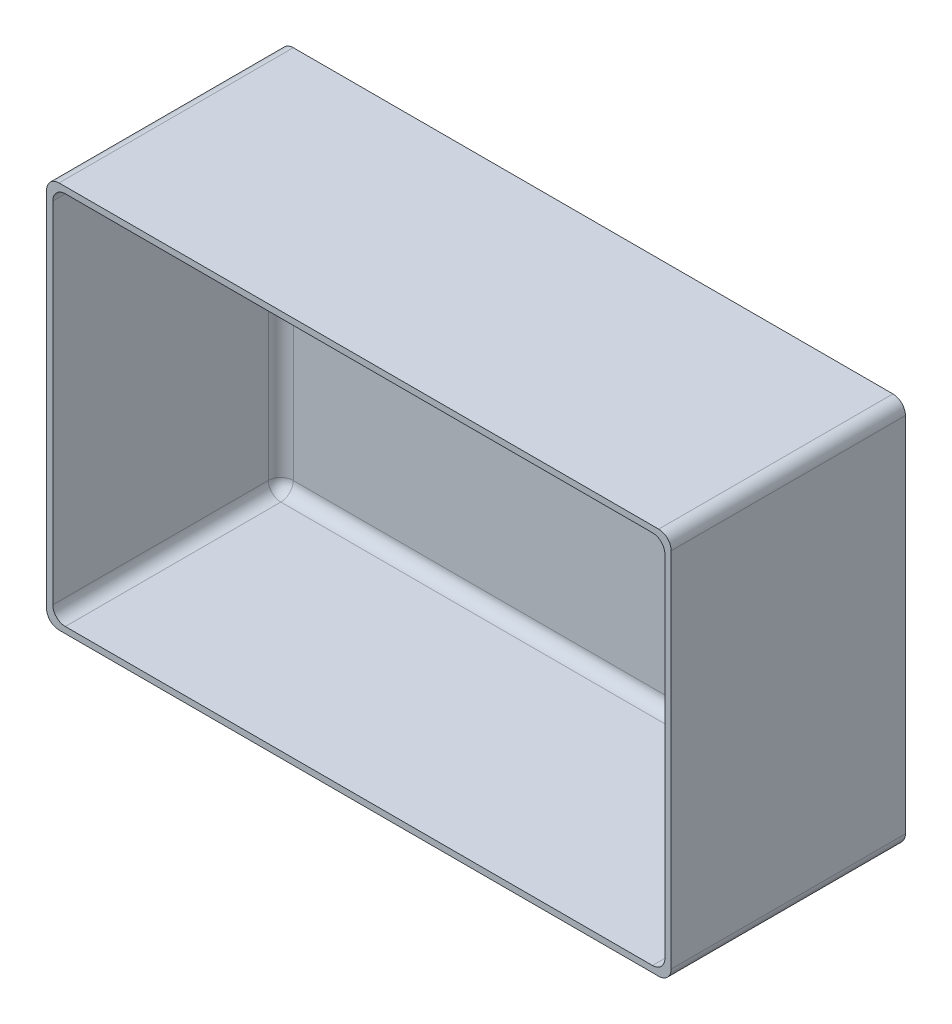
ISO-10303-21;
HEADER;
FILE_DESCRIPTION(('STEP AP214'),'2;1');
FILE_NAME('part.step','',(''),(''),'','','');
FILE_SCHEMA(('AUTOMOTIVE_DESIGN { 1 0 10303 214 1 1 1 1 }'));
ENDSEC;
DATA;
#1=APPLICATION_CONTEXT('core data for automotive mechanical design processes');
#2=APPLICATION_PROTOCOL_DEFINITION('international standard','automotive_design',2000,#1);
#3=PRODUCT_CONTEXT('',#1,'mechanical');
#4=PRODUCT('Part','Part','',(#3));
#5=PRODUCT_RELATED_PRODUCT_CATEGORY('part','',(#4));
#6=PRODUCT_DEFINITION_FORMATION('','',#4);
#7=PRODUCT_DEFINITION_CONTEXT('part definition',#1,'design');
#8=PRODUCT_DEFINITION('design','',#6,#7);
#9=PRODUCT_DEFINITION_SHAPE('','',#8);
#10=(LENGTH_UNIT() NAMED_UNIT(*) SI_UNIT(.MILLI.,.METRE.));
#11=(NAMED_UNIT(*) PLANE_ANGLE_UNIT() SI_UNIT($,.RADIAN.));
#12=(NAMED_UNIT(*) SI_UNIT($,.STERADIAN.) SOLID_ANGLE_UNIT());
#13=UNCERTAINTY_MEASURE_WITH_UNIT(LENGTH_MEASURE(1.E-05),#10,'distance_accuracy_value','');
#14=(GEOMETRIC_REPRESENTATION_CONTEXT(3) GLOBAL_UNCERTAINTY_ASSIGNED_CONTEXT((#13)) GLOBAL_UNIT_ASSIGNED_CONTEXT((#10,
#11,#12)) REPRESENTATION_CONTEXT('',''));
#15=CARTESIAN_POINT('',(0.,0.,0.));
#16=DIRECTION('',(0.,0.,1.));
#17=DIRECTION('',(1.,0.,0.));
#18=AXIS2_PLACEMENT_3D('',#15,#16,#17);
#19=CARTESIAN_POINT('',(40.,24.8,30.));
#20=DIRECTION('',(-1.,0.,0.));
#21=DIRECTION('',(0.,-1.,0.));
#22=AXIS2_PLACEMENT_3D('',#19,#20,#21);
#23=PLANE('',#22);
#24=DIRECTION('',(0.,1.,0.));
#25=VECTOR('',#24,1.);
#26=CARTESIAN_POINT('',(40.,24.8,30.));
#27=LINE('',#26,#25);
#28=CARTESIAN_POINT('',(40.,-23.2,30.));
#29=VERTEX_POINT('',#28);
#30=CARTESIAN_POINT('',(40.,23.2,30.));
#31=VERTEX_POINT('',#30);
#32=EDGE_CURVE('E178',#29,#31,#27,.T.);
#33=ORIENTED_EDGE('',*,*,#32,.F.);
#34=DIRECTION('',(0.,0.,-1.));
#35=VECTOR('',#34,1.);
#36=CARTESIAN_POINT('',(40.,-23.2,30.));
#37=LINE('',#36,#35);
#38=CARTESIAN_POINT('',(40.,-23.2,0.));
#39=VERTEX_POINT('',#38);
#40=EDGE_CURVE('E163',#29,#39,#37,.T.);
#41=ORIENTED_EDGE('',*,*,#40,.T.);
#42=DIRECTION('',(0.,1.,0.));
#43=VECTOR('',#42,1.);
#44=CARTESIAN_POINT('',(40.,24.8,0.));
#45=LINE('',#44,#43);
#46=CARTESIAN_POINT('',(40.,23.2,0.));
#47=VERTEX_POINT('',#46);
#48=EDGE_CURVE('E175',#39,#47,#45,.T.);
#49=ORIENTED_EDGE('',*,*,#48,.T.);
#50=DIRECTION('',(0.,0.,-1.));
#51=VECTOR('',#50,1.);
#52=CARTESIAN_POINT('',(40.,23.2,30.));
#53=LINE('',#52,#51);
#54=EDGE_CURVE('E180',#47,#31,#53,.F.);
#55=ORIENTED_EDGE('',*,*,#54,.T.);
#56=EDGE_LOOP('',(#33,#41,#49,#55));
#57=FACE_BOUND('',#56,.T.);
#58=ADVANCED_FACE('F33',(#57),#23,.F.);
#59=CARTESIAN_POINT('',(-40.,24.8,30.));
#60=DIRECTION('',(0.,-1.,0.));
#61=DIRECTION('',(0.,0.,-1.));
#62=AXIS2_PLACEMENT_3D('',#59,#60,#61);
#63=PLANE('',#62);
#64=DIRECTION('',(-1.,0.,0.));
#65=VECTOR('',#64,1.);
#66=CARTESIAN_POINT('',(-40.,24.8,0.));
#67=LINE('',#66,#65);
#68=CARTESIAN_POINT('',(38.4,24.8,0.));
#69=VERTEX_POINT('',#68);
#70=CARTESIAN_POINT('',(-38.4,24.8,0.));
#71=VERTEX_POINT('',#70);
#72=EDGE_CURVE('E185',#69,#71,#67,.T.);
#73=ORIENTED_EDGE('',*,*,#72,.T.);
#74=DIRECTION('',(0.,0.,-1.));
#75=VECTOR('',#74,1.);
#76=CARTESIAN_POINT('',(-38.4,24.8,30.));
#77=LINE('',#76,#75);
#78=CARTESIAN_POINT('',(-38.4,24.8,30.));
#79=VERTEX_POINT('',#78);
#80=EDGE_CURVE('E225',#71,#79,#77,.F.);
#81=ORIENTED_EDGE('',*,*,#80,.T.);
#82=DIRECTION('',(-1.,0.,0.));
#83=VECTOR('',#82,1.);
#84=CARTESIAN_POINT('',(-40.,24.8,30.));
#85=LINE('',#84,#83);
#86=CARTESIAN_POINT('',(38.4,24.8,30.));
#87=VERTEX_POINT('',#86);
#88=EDGE_CURVE('E310',#87,#79,#85,.T.);
#89=ORIENTED_EDGE('',*,*,#88,.F.);
#90=DIRECTION('',(0.,0.,-1.));
#91=VECTOR('',#90,1.);
#92=CARTESIAN_POINT('',(38.4,24.8,30.));
#93=LINE('',#92,#91);
#94=EDGE_CURVE('E222',#87,#69,#93,.T.);
#95=ORIENTED_EDGE('',*,*,#94,.T.);
#96=EDGE_LOOP('',(#73,#81,#89,#95));
#97=FACE_BOUND('',#96,.T.);
#98=ADVANCED_FACE('F335',(#97),#63,.F.);
#99=CARTESIAN_POINT('',(-40.,24.8,30.));
#100=DIRECTION('',(1.,0.,0.));
#101=DIRECTION('',(0.,0.,-1.));
#102=AXIS2_PLACEMENT_3D('',#99,#100,#101);
#103=PLANE('',#102);
#104=DIRECTION('',(0.,-1.,0.));
#105=VECTOR('',#104,1.);
#106=CARTESIAN_POINT('',(-40.,24.8,30.));
#107=LINE('',#106,#105);
#108=CARTESIAN_POINT('',(-40.,23.2,30.));
#109=VERTEX_POINT('',#108);
#110=CARTESIAN_POINT('',(-40.,-23.2,30.));
#111=VERTEX_POINT('',#110);
#112=EDGE_CURVE('E312',#109,#111,#107,.T.);
#113=ORIENTED_EDGE('',*,*,#112,.F.);
#114=DIRECTION('',(0.,0.,-1.));
#115=VECTOR('',#114,1.);
#116=CARTESIAN_POINT('',(-40.,23.2,30.));
#117=LINE('',#116,#115);
#118=CARTESIAN_POINT('',(-40.,23.2,0.));
#119=VERTEX_POINT('',#118);
#120=EDGE_CURVE('E219',#109,#119,#117,.T.);
#121=ORIENTED_EDGE('',*,*,#120,.T.);
#122=DIRECTION('',(0.,-1.,0.));
#123=VECTOR('',#122,1.);
#124=CARTESIAN_POINT('',(-40.,24.8,0.));
#125=LINE('',#124,#123);
#126=CARTESIAN_POINT('',(-40.,-23.2,0.));
#127=VERTEX_POINT('',#126);
#128=EDGE_CURVE('E189',#119,#127,#125,.T.);
#129=ORIENTED_EDGE('',*,*,#128,.T.);
#130=DIRECTION('',(0.,0.,-1.));
#131=VECTOR('',#130,1.);
#132=CARTESIAN_POINT('',(-40.,-23.2,30.));
#133=LINE('',#132,#131);
#134=EDGE_CURVE('E217',#127,#111,#133,.F.);
#135=ORIENTED_EDGE('',*,*,#134,.T.);
#136=EDGE_LOOP('',(#113,#121,#129,#135));
#137=FACE_BOUND('',#136,.T.);
#138=ADVANCED_FACE('F328',(#137),#103,.F.);
#139=CARTESIAN_POINT('',(-40.,-24.8,30.));
#140=DIRECTION('',(0.,1.,0.));
#141=DIRECTION('',(0.,0.,1.));
#142=AXIS2_PLACEMENT_3D('',#139,#140,#141);
#143=PLANE('',#142);
#144=DIRECTION('',(1.,0.,0.));
#145=VECTOR('',#144,1.);
#146=CARTESIAN_POINT('',(-40.,-24.8,0.));
#147=LINE('',#146,#145);
#148=CARTESIAN_POINT('',(-38.4,-24.8,0.));
#149=VERTEX_POINT('',#148);
#150=CARTESIAN_POINT('',(38.4,-24.8,0.));
#151=VERTEX_POINT('',#150);
#152=EDGE_CURVE('E200',#149,#151,#147,.T.);
#153=ORIENTED_EDGE('',*,*,#152,.T.);
#154=DIRECTION('',(0.,0.,-1.));
#155=VECTOR('',#154,1.);
#156=CARTESIAN_POINT('',(38.4,-24.8,30.));
#157=LINE('',#156,#155);
#158=CARTESIAN_POINT('',(38.4,-24.8,30.));
#159=VERTEX_POINT('',#158);
#160=EDGE_CURVE('E164',#151,#159,#157,.F.);
#161=ORIENTED_EDGE('',*,*,#160,.T.);
#162=DIRECTION('',(1.,0.,0.));
#163=VECTOR('',#162,1.);
#164=CARTESIAN_POINT('',(-40.,-24.8,30.));
#165=LINE('',#164,#163);
#166=CARTESIAN_POINT('',(-38.4,-24.8,30.));
#167=VERTEX_POINT('',#166);
#168=EDGE_CURVE('E195',#167,#159,#165,.T.);
#169=ORIENTED_EDGE('',*,*,#168,.F.);
#170=DIRECTION('',(0.,0.,-1.));
#171=VECTOR('',#170,1.);
#172=CARTESIAN_POINT('',(-38.4,-24.8,30.));
#173=LINE('',#172,#171);
#174=EDGE_CURVE('E169',#167,#149,#173,.T.);
#175=ORIENTED_EDGE('',*,*,#174,.T.);
#176=EDGE_LOOP('',(#153,#161,#169,#175));
#177=FACE_BOUND('',#176,.T.);
#178=ADVANCED_FACE('F322',(#177),#143,.F.);
#179=CARTESIAN_POINT('',(0.,0.,30.));
#180=DIRECTION('',(0.,0.,1.));
#181=DIRECTION('',(1.,0.,0.));
#182=AXIS2_PLACEMENT_3D('',#179,#180,#181);
#183=PLANE('',#182);
#184=DIRECTION('',(0.,1.,0.));
#185=VECTOR('',#184,1.);
#186=CARTESIAN_POINT('',(39.2,24.8,30.));
#187=LINE('',#186,#185);
#188=CARTESIAN_POINT('',(39.2,-22.4,30.));
#189=VERTEX_POINT('',#188);
#190=CARTESIAN_POINT('',(39.2,22.4,30.));
#191=VERTEX_POINT('',#190);
#192=EDGE_CURVE('E297',#189,#191,#187,.T.);
#193=ORIENTED_EDGE('',*,*,#192,.F.);
#194=CARTESIAN_POINT('',(37.6,-22.4,30.));
#195=DIRECTION('',(0.,0.,1.));
#196=DIRECTION('',(1.,0.,0.));
#197=AXIS2_PLACEMENT_3D('',#194,#195,#196);
#198=CIRCLE('',#197,1.6);
#199=CARTESIAN_POINT('',(37.6,-24.,30.));
#200=VERTEX_POINT('',#199);
#201=EDGE_CURVE('E259',#189,#200,#198,.F.);
#202=ORIENTED_EDGE('',*,*,#201,.T.);
#203=DIRECTION('',(1.,0.,0.));
#204=VECTOR('',#203,1.);
#205=CARTESIAN_POINT('',(-40.,-24.,30.));
#206=LINE('',#205,#204);
#207=CARTESIAN_POINT('',(-37.6,-24.,30.));
#208=VERTEX_POINT('',#207);
#209=EDGE_CURVE('E186',#208,#200,#206,.T.);
#210=ORIENTED_EDGE('',*,*,#209,.F.);
#211=CARTESIAN_POINT('',(-37.6,-22.4,30.));
#212=DIRECTION('',(0.,0.,1.));
#213=DIRECTION('',(1.,0.,0.));
#214=AXIS2_PLACEMENT_3D('',#211,#212,#213);
#215=CIRCLE('',#214,1.6);
#216=CARTESIAN_POINT('',(-39.2,-22.4,30.));
#217=VERTEX_POINT('',#216);
#218=EDGE_CURVE('E261',#208,#217,#215,.F.);
#219=ORIENTED_EDGE('',*,*,#218,.T.);
#220=DIRECTION('',(0.,-1.,0.));
#221=VECTOR('',#220,1.);
#222=CARTESIAN_POINT('',(-39.2,24.8,30.));
#223=LINE('',#222,#221);
#224=CARTESIAN_POINT('',(-39.2,22.4,30.));
#225=VERTEX_POINT('',#224);
#226=EDGE_CURVE('E192',#225,#217,#223,.T.);
#227=ORIENTED_EDGE('',*,*,#226,.F.);
#228=CARTESIAN_POINT('',(-37.6,22.4,30.));
#229=DIRECTION('',(0.,0.,1.));
#230=DIRECTION('',(1.,0.,0.));
#231=AXIS2_PLACEMENT_3D('',#228,#229,#230);
#232=CIRCLE('',#231,1.6);
#233=CARTESIAN_POINT('',(-37.6,24.,30.));
#234=VERTEX_POINT('',#233);
#235=EDGE_CURVE('E11',#225,#234,#232,.F.);
#236=ORIENTED_EDGE('',*,*,#235,.T.);
#237=DIRECTION('',(-1.,0.,0.));
#238=VECTOR('',#237,1.);
#239=CARTESIAN_POINT('',(-40.,24.,30.));
#240=LINE('',#239,#238);
#241=CARTESIAN_POINT('',(37.6,24.,30.));
#242=VERTEX_POINT('',#241);
#243=EDGE_CURVE('E300',#242,#234,#240,.T.);
#244=ORIENTED_EDGE('',*,*,#243,.F.);
#245=CARTESIAN_POINT('',(37.6,22.4,30.));
#246=DIRECTION('',(0.,0.,1.));
#247=DIRECTION('',(1.,0.,0.));
#248=AXIS2_PLACEMENT_3D('',#245,#246,#247);
#249=CIRCLE('',#248,1.6);
#250=EDGE_CURVE('E42',#242,#191,#249,.F.);
#251=ORIENTED_EDGE('',*,*,#250,.T.);
#252=EDGE_LOOP('',(#193,#202,#210,#219,#227,#236,#244,#251));
#253=FACE_BOUND('',#252,.T.);
#254=ORIENTED_EDGE('',*,*,#168,.T.);
#255=CARTESIAN_POINT('',(38.4,-23.2,30.));
#256=DIRECTION('',(0.,0.,1.));
#257=DIRECTION('',(1.,0.,0.));
#258=AXIS2_PLACEMENT_3D('',#255,#256,#257);
#259=CIRCLE('',#258,1.6);
#260=EDGE_CURVE('E215',#159,#29,#259,.T.);
#261=ORIENTED_EDGE('',*,*,#260,.T.);
#262=ORIENTED_EDGE('',*,*,#32,.T.);
#263=CARTESIAN_POINT('',(38.4,23.2,30.));
#264=DIRECTION('',(0.,0.,1.));
#265=DIRECTION('',(1.,0.,0.));
#266=AXIS2_PLACEMENT_3D('',#263,#264,#265);
#267=CIRCLE('',#266,1.6);
#268=EDGE_CURVE('E211',#31,#87,#267,.T.);
#269=ORIENTED_EDGE('',*,*,#268,.T.);
#270=ORIENTED_EDGE('',*,*,#88,.T.);
#271=CARTESIAN_POINT('',(-38.4,23.2,30.));
#272=DIRECTION('',(0.,0.,1.));
#273=DIRECTION('',(1.,0.,0.));
#274=AXIS2_PLACEMENT_3D('',#271,#272,#273);
#275=CIRCLE('',#274,1.6);
#276=EDGE_CURVE('E213',#79,#109,#275,.T.);
#277=ORIENTED_EDGE('',*,*,#276,.T.);
#278=ORIENTED_EDGE('',*,*,#112,.T.);
#279=CARTESIAN_POINT('',(-38.4,-23.2,30.));
#280=DIRECTION('',(0.,0.,1.));
#281=DIRECTION('',(1.,0.,0.));
#282=AXIS2_PLACEMENT_3D('',#279,#280,#281);
#283=CIRCLE('',#282,1.6);
#284=EDGE_CURVE('E209',#111,#167,#283,.T.);
#285=ORIENTED_EDGE('',*,*,#284,.T.);
#286=EDGE_LOOP('',(#254,#261,#262,#269,#270,#277,#278,#285));
#287=FACE_BOUND('',#286,.T.);
#288=ADVANCED_FACE('F319',(#253,#287),#183,.T.);
#289=CARTESIAN_POINT('',(0.,0.,0.));
#290=DIRECTION('',(0.,0.,1.));
#291=DIRECTION('',(1.,0.,0.));
#292=AXIS2_PLACEMENT_3D('',#289,#290,#291);
#293=PLANE('',#292);
#294=ORIENTED_EDGE('',*,*,#48,.F.);
#295=CARTESIAN_POINT('',(38.4,-23.2,0.));
#296=DIRECTION('',(0.,0.,1.));
#297=DIRECTION('',(1.,0.,0.));
#298=AXIS2_PLACEMENT_3D('',#295,#296,#297);
#299=CIRCLE('',#298,1.6);
#300=EDGE_CURVE('E159',#39,#151,#299,.F.);
#301=ORIENTED_EDGE('',*,*,#300,.T.);
#302=ORIENTED_EDGE('',*,*,#152,.F.);
#303=CARTESIAN_POINT('',(-38.4,-23.2,0.));
#304=DIRECTION('',(0.,0.,1.));
#305=DIRECTION('',(1.,0.,0.));
#306=AXIS2_PLACEMENT_3D('',#303,#304,#305);
#307=CIRCLE('',#306,1.6);
#308=EDGE_CURVE('E179',#149,#127,#307,.F.);
#309=ORIENTED_EDGE('',*,*,#308,.T.);
#310=ORIENTED_EDGE('',*,*,#128,.F.);
#311=CARTESIAN_POINT('',(-38.4,23.2,0.));
#312=DIRECTION('',(0.,0.,1.));
#313=DIRECTION('',(1.,0.,0.));
#314=AXIS2_PLACEMENT_3D('',#311,#312,#313);
#315=CIRCLE('',#314,1.6);
#316=EDGE_CURVE('E170',#119,#71,#315,.F.);
#317=ORIENTED_EDGE('',*,*,#316,.T.);
#318=ORIENTED_EDGE('',*,*,#72,.F.);
#319=CARTESIAN_POINT('',(38.4,23.2,0.));
#320=DIRECTION('',(0.,0.,1.));
#321=DIRECTION('',(1.,0.,0.));
#322=AXIS2_PLACEMENT_3D('',#319,#320,#321);
#323=CIRCLE('',#322,1.6);
#324=EDGE_CURVE('E184',#69,#47,#323,.F.);
#325=ORIENTED_EDGE('',*,*,#324,.T.);
#326=EDGE_LOOP('',(#294,#301,#302,#309,#310,#317,#318,#325));
#327=FACE_BOUND('',#326,.T.);
#328=ADVANCED_FACE('F182',(#327),#293,.F.);
#329=CARTESIAN_POINT('',(39.2,24.8,30.));
#330=DIRECTION('',(-1.,0.,0.));
#331=DIRECTION('',(0.,-1.,0.));
#332=AXIS2_PLACEMENT_3D('',#329,#330,#331);
#333=PLANE('',#332);
#334=DIRECTION('',(0.,1.,0.));
#335=VECTOR('',#334,1.);
#336=CARTESIAN_POINT('',(39.2,-24.,2.4));
#337=LINE('',#336,#335);
#338=CARTESIAN_POINT('',(39.2,22.4,2.4));
#339=VERTEX_POINT('',#338);
#340=CARTESIAN_POINT('',(39.2,-22.4,2.4));
#341=VERTEX_POINT('',#340);
#342=EDGE_CURVE('E238',#339,#341,#337,.F.);
#343=ORIENTED_EDGE('',*,*,#342,.T.);
#344=DIRECTION('',(0.,0.,-1.));
#345=VECTOR('',#344,1.);
#346=CARTESIAN_POINT('',(39.2,-22.4,30.));
#347=LINE('',#346,#345);
#348=EDGE_CURVE('E241',#341,#189,#347,.F.);
#349=ORIENTED_EDGE('',*,*,#348,.T.);
#350=ORIENTED_EDGE('',*,*,#192,.T.);
#351=DIRECTION('',(0.,0.,-1.));
#352=VECTOR('',#351,1.);
#353=CARTESIAN_POINT('',(39.2,22.4,0.799999999999999));
#354=LINE('',#353,#352);
#355=EDGE_CURVE('E236',#191,#339,#354,.T.);
#356=ORIENTED_EDGE('',*,*,#355,.T.);
#357=EDGE_LOOP('',(#343,#349,#350,#356));
#358=FACE_BOUND('',#357,.T.);
#359=ADVANCED_FACE('F378',(#358),#333,.T.);
#360=CARTESIAN_POINT('',(-40.,24.,30.));
#361=DIRECTION('',(0.,-1.,0.));
#362=DIRECTION('',(0.,0.,-1.));
#363=AXIS2_PLACEMENT_3D('',#360,#361,#362);
#364=PLANE('',#363);
#365=DIRECTION('',(-1.,0.,0.));
#366=VECTOR('',#365,1.);
#367=CARTESIAN_POINT('',(39.2,24.,2.4));
#368=LINE('',#367,#366);
#369=CARTESIAN_POINT('',(-37.6,24.,2.4));
#370=VERTEX_POINT('',#369);
#371=CARTESIAN_POINT('',(37.6,24.,2.4));
#372=VERTEX_POINT('',#371);
#373=EDGE_CURVE('E50',#370,#372,#368,.F.);
#374=ORIENTED_EDGE('',*,*,#373,.T.);
#375=DIRECTION('',(0.,0.,-1.));
#376=VECTOR('',#375,1.);
#377=CARTESIAN_POINT('',(37.6,24.,30.));
#378=LINE('',#377,#376);
#379=EDGE_CURVE('E257',#372,#242,#378,.F.);
#380=ORIENTED_EDGE('',*,*,#379,.T.);
#381=ORIENTED_EDGE('',*,*,#243,.T.);
#382=DIRECTION('',(0.,0.,-1.));
#383=VECTOR('',#382,1.);
#384=CARTESIAN_POINT('',(-37.6,24.,0.799999999999999));
#385=LINE('',#384,#383);
#386=EDGE_CURVE('E55',#234,#370,#385,.T.);
#387=ORIENTED_EDGE('',*,*,#386,.T.);
#388=EDGE_LOOP('',(#374,#380,#381,#387));
#389=FACE_BOUND('',#388,.T.);
#390=ADVANCED_FACE('F403',(#389),#364,.T.);
#391=CARTESIAN_POINT('',(-39.2,24.8,30.));
#392=DIRECTION('',(1.,0.,0.));
#393=DIRECTION('',(0.,0.,-1.));
#394=AXIS2_PLACEMENT_3D('',#391,#392,#393);
#395=PLANE('',#394);
#396=ORIENTED_EDGE('',*,*,#226,.T.);
#397=DIRECTION('',(0.,0.,-1.));
#398=VECTOR('',#397,1.);
#399=CARTESIAN_POINT('',(-39.2,-22.4,0.799999999999999));
#400=LINE('',#399,#398);
#401=CARTESIAN_POINT('',(-39.2,-22.4,2.4));
#402=VERTEX_POINT('',#401);
#403=EDGE_CURVE('E247',#217,#402,#400,.T.);
#404=ORIENTED_EDGE('',*,*,#403,.T.);
#405=DIRECTION('',(0.,-1.,0.));
#406=VECTOR('',#405,1.);
#407=CARTESIAN_POINT('',(-39.2,24.,2.4));
#408=LINE('',#407,#406);
#409=CARTESIAN_POINT('',(-39.2,22.4,2.4));
#410=VERTEX_POINT('',#409);
#411=EDGE_CURVE('E245',#402,#410,#408,.F.);
#412=ORIENTED_EDGE('',*,*,#411,.T.);
#413=DIRECTION('',(0.,0.,-1.));
#414=VECTOR('',#413,1.);
#415=CARTESIAN_POINT('',(-39.2,22.4,30.));
#416=LINE('',#415,#414);
#417=EDGE_CURVE('E243',#410,#225,#416,.F.);
#418=ORIENTED_EDGE('',*,*,#417,.T.);
#419=EDGE_LOOP('',(#396,#404,#412,#418));
#420=FACE_BOUND('',#419,.T.);
#421=ADVANCED_FACE('F368',(#420),#395,.T.);
#422=CARTESIAN_POINT('',(-40.,-24.,30.));
#423=DIRECTION('',(0.,1.,0.));
#424=DIRECTION('',(0.,0.,1.));
#425=AXIS2_PLACEMENT_3D('',#422,#423,#424);
#426=PLANE('',#425);
#427=ORIENTED_EDGE('',*,*,#209,.T.);
#428=DIRECTION('',(0.,0.,-1.));
#429=VECTOR('',#428,1.);
#430=CARTESIAN_POINT('',(37.6,-24.,0.799999999999999));
#431=LINE('',#430,#429);
#432=CARTESIAN_POINT('',(37.6,-24.,2.4));
#433=VERTEX_POINT('',#432);
#434=EDGE_CURVE('E253',#200,#433,#431,.T.);
#435=ORIENTED_EDGE('',*,*,#434,.T.);
#436=DIRECTION('',(1.,0.,0.));
#437=VECTOR('',#436,1.);
#438=CARTESIAN_POINT('',(-39.2,-24.,2.4));
#439=LINE('',#438,#437);
#440=CARTESIAN_POINT('',(-37.6,-24.,2.4));
#441=VERTEX_POINT('',#440);
#442=EDGE_CURVE('E251',#433,#441,#439,.F.);
#443=ORIENTED_EDGE('',*,*,#442,.T.);
#444=DIRECTION('',(0.,0.,-1.));
#445=VECTOR('',#444,1.);
#446=CARTESIAN_POINT('',(-37.6,-24.,30.));
#447=LINE('',#446,#445);
#448=EDGE_CURVE('E249',#441,#208,#447,.F.);
#449=ORIENTED_EDGE('',*,*,#448,.T.);
#450=EDGE_LOOP('',(#427,#435,#443,#449));
#451=FACE_BOUND('',#450,.T.);
#452=ADVANCED_FACE('F362',(#451),#426,.T.);
#453=CARTESIAN_POINT('',(0.,0.,0.8));
#454=DIRECTION('',(0.,0.,1.));
#455=DIRECTION('',(1.,0.,0.));
#456=AXIS2_PLACEMENT_3D('',#453,#454,#455);
#457=PLANE('',#456);
#458=DIRECTION('',(0.,-1.,0.));
#459=VECTOR('',#458,1.);
#460=CARTESIAN_POINT('',(-37.6,-24.,0.8));
#461=LINE('',#460,#459);
#462=CARTESIAN_POINT('',(-37.6,22.4,0.8));
#463=VERTEX_POINT('',#462);
#464=CARTESIAN_POINT('',(-37.6,-22.4,0.8));
#465=VERTEX_POINT('',#464);
#466=EDGE_CURVE('E229',#463,#465,#461,.T.);
#467=ORIENTED_EDGE('',*,*,#466,.T.);
#468=DIRECTION('',(1.,0.,0.));
#469=VECTOR('',#468,1.);
#470=CARTESIAN_POINT('',(39.2,-22.4,0.8));
#471=LINE('',#470,#469);
#472=CARTESIAN_POINT('',(37.6,-22.4,0.8));
#473=VERTEX_POINT('',#472);
#474=EDGE_CURVE('E234',#465,#473,#471,.T.);
#475=ORIENTED_EDGE('',*,*,#474,.T.);
#476=DIRECTION('',(0.,1.,0.));
#477=VECTOR('',#476,1.);
#478=CARTESIAN_POINT('',(37.6,24.,0.8));
#479=LINE('',#478,#477);
#480=CARTESIAN_POINT('',(37.6,22.4,0.8));
#481=VERTEX_POINT('',#480);
#482=EDGE_CURVE('E231',#473,#481,#479,.T.);
#483=ORIENTED_EDGE('',*,*,#482,.T.);
#484=DIRECTION('',(-1.,0.,0.));
#485=VECTOR('',#484,1.);
#486=CARTESIAN_POINT('',(-39.2,22.4,0.8));
#487=LINE('',#486,#485);
#488=EDGE_CURVE('E227',#481,#463,#487,.T.);
#489=ORIENTED_EDGE('',*,*,#488,.T.);
#490=EDGE_LOOP('',(#467,#475,#483,#489));
#491=FACE_BOUND('',#490,.T.);
#492=ADVANCED_FACE('F358',(#491),#457,.T.);
#493=CARTESIAN_POINT('',(38.4,-23.2,30.));
#494=DIRECTION('',(0.,0.,-1.));
#495=DIRECTION('',(-1.,0.,0.));
#496=AXIS2_PLACEMENT_3D('',#493,#494,#495);
#497=CYLINDRICAL_SURFACE('',#496,1.6);
#498=ORIENTED_EDGE('',*,*,#260,.F.);
#499=ORIENTED_EDGE('',*,*,#160,.F.);
#500=ORIENTED_EDGE('',*,*,#300,.F.);
#501=ORIENTED_EDGE('',*,*,#40,.F.);
#502=EDGE_LOOP('',(#498,#499,#500,#501));
#503=FACE_BOUND('',#502,.T.);
#504=ADVANCED_FACE('F162',(#503),#497,.T.);
#505=CARTESIAN_POINT('',(-38.4,23.2,30.));
#506=DIRECTION('',(0.,0.,-1.));
#507=DIRECTION('',(-1.,0.,0.));
#508=AXIS2_PLACEMENT_3D('',#505,#506,#507);
#509=CYLINDRICAL_SURFACE('',#508,1.6);
#510=ORIENTED_EDGE('',*,*,#276,.F.);
#511=ORIENTED_EDGE('',*,*,#80,.F.);
#512=ORIENTED_EDGE('',*,*,#316,.F.);
#513=ORIENTED_EDGE('',*,*,#120,.F.);
#514=EDGE_LOOP('',(#510,#511,#512,#513));
#515=FACE_BOUND('',#514,.T.);
#516=ADVANCED_FACE('F332',(#515),#509,.T.);
#517=CARTESIAN_POINT('',(38.4,23.2,30.));
#518=DIRECTION('',(0.,0.,-1.));
#519=DIRECTION('',(-1.,0.,0.));
#520=AXIS2_PLACEMENT_3D('',#517,#518,#519);
#521=CYLINDRICAL_SURFACE('',#520,1.6);
#522=ORIENTED_EDGE('',*,*,#268,.F.);
#523=ORIENTED_EDGE('',*,*,#54,.F.);
#524=ORIENTED_EDGE('',*,*,#324,.F.);
#525=ORIENTED_EDGE('',*,*,#94,.F.);
#526=EDGE_LOOP('',(#522,#523,#524,#525));
#527=FACE_BOUND('',#526,.T.);
#528=ADVANCED_FACE('F340',(#527),#521,.T.);
#529=CARTESIAN_POINT('',(-38.4,-23.2,30.));
#530=DIRECTION('',(0.,0.,-1.));
#531=DIRECTION('',(-1.,0.,0.));
#532=AXIS2_PLACEMENT_3D('',#529,#530,#531);
#533=CYLINDRICAL_SURFACE('',#532,1.6);
#534=ORIENTED_EDGE('',*,*,#284,.F.);
#535=ORIENTED_EDGE('',*,*,#134,.F.);
#536=ORIENTED_EDGE('',*,*,#308,.F.);
#537=ORIENTED_EDGE('',*,*,#174,.F.);
#538=EDGE_LOOP('',(#534,#535,#536,#537));
#539=FACE_BOUND('',#538,.T.);
#540=ADVANCED_FACE('F324',(#539),#533,.T.);
#541=CARTESIAN_POINT('',(-37.6,-22.4,30.));
#542=DIRECTION('',(0.,0.,1.));
#543=DIRECTION('',(1.,0.,0.));
#544=AXIS2_PLACEMENT_3D('',#541,#542,#543);
#545=CYLINDRICAL_SURFACE('',#544,1.6);
#546=ORIENTED_EDGE('',*,*,#218,.F.);
#547=ORIENTED_EDGE('',*,*,#448,.F.);
#548=CARTESIAN_POINT('',(-37.6,-22.4,2.4));
#549=DIRECTION('',(0.,0.,1.));
#550=DIRECTION('',(1.,0.,0.));
#551=AXIS2_PLACEMENT_3D('',#548,#549,#550);
#552=CIRCLE('',#551,1.6);
#553=EDGE_CURVE('E37',#402,#441,#552,.T.);
#554=ORIENTED_EDGE('',*,*,#553,.F.);
#555=ORIENTED_EDGE('',*,*,#403,.F.);
#556=EDGE_LOOP('',(#546,#547,#554,#555));
#557=FACE_BOUND('',#556,.T.);
#558=ADVANCED_FACE('F35',(#557),#545,.F.);
#559=CARTESIAN_POINT('',(-37.6,0.,2.4));
#560=DIRECTION('',(0.,1.,0.));
#561=DIRECTION('',(0.,0.,1.));
#562=AXIS2_PLACEMENT_3D('',#559,#560,#561);
#563=CYLINDRICAL_SURFACE('',#562,1.6);
#564=CARTESIAN_POINT('',(-37.6,22.4,2.4));
#565=DIRECTION('',(0.,-1.,0.));
#566=DIRECTION('',(0.,0.,-1.));
#567=AXIS2_PLACEMENT_3D('',#564,#565,#566);
#568=CIRCLE('',#567,1.6);
#569=EDGE_CURVE('E289',#410,#463,#568,.T.);
#570=ORIENTED_EDGE('',*,*,#569,.F.);
#571=ORIENTED_EDGE('',*,*,#411,.F.);
#572=CARTESIAN_POINT('',(-37.6,-22.4,2.4));
#573=DIRECTION('',(0.,1.,0.));
#574=DIRECTION('',(0.,0.,1.));
#575=AXIS2_PLACEMENT_3D('',#572,#573,#574);
#576=CIRCLE('',#575,1.6);
#577=EDGE_CURVE('E291',#465,#402,#576,.T.);
#578=ORIENTED_EDGE('',*,*,#577,.F.);
#579=ORIENTED_EDGE('',*,*,#466,.F.);
#580=EDGE_LOOP('',(#570,#571,#578,#579));
#581=FACE_BOUND('',#580,.T.);
#582=ADVANCED_FACE('F453',(#581),#563,.F.);
#583=CARTESIAN_POINT('',(-37.6,22.4,30.));
#584=DIRECTION('',(0.,0.,1.));
#585=DIRECTION('',(1.,0.,0.));
#586=AXIS2_PLACEMENT_3D('',#583,#584,#585);
#587=CYLINDRICAL_SURFACE('',#586,1.6);
#588=ORIENTED_EDGE('',*,*,#235,.F.);
#589=ORIENTED_EDGE('',*,*,#417,.F.);
#590=CARTESIAN_POINT('',(-37.6,22.4,2.4));
#591=DIRECTION('',(0.,0.,1.));
#592=DIRECTION('',(1.,0.,0.));
#593=AXIS2_PLACEMENT_3D('',#590,#591,#592);
#594=CIRCLE('',#593,1.6);
#595=EDGE_CURVE('E286',#370,#410,#594,.T.);
#596=ORIENTED_EDGE('',*,*,#595,.F.);
#597=ORIENTED_EDGE('',*,*,#386,.F.);
#598=EDGE_LOOP('',(#588,#589,#596,#597));
#599=FACE_BOUND('',#598,.T.);
#600=ADVANCED_FACE('F462',(#599),#587,.F.);
#601=CARTESIAN_POINT('',(-37.6,-22.4,2.4));
#602=DIRECTION('',(-1.,0.,0.));
#603=DIRECTION('',(0.,0.,1.));
#604=AXIS2_PLACEMENT_3D('',#601,#602,#603);
#605=SPHERICAL_SURFACE('',#604,1.6);
#606=ORIENTED_EDGE('',*,*,#577,.T.);
#607=ORIENTED_EDGE('',*,*,#553,.T.);
#608=CARTESIAN_POINT('',(-37.6,-22.4,2.4));
#609=DIRECTION('',(1.,0.,0.));
#610=DIRECTION('',(0.,0.,-1.));
#611=AXIS2_PLACEMENT_3D('',#608,#609,#610);
#612=CIRCLE('',#611,1.6);
#613=EDGE_CURVE('E283',#465,#441,#612,.F.);
#614=ORIENTED_EDGE('',*,*,#613,.F.);
#615=EDGE_LOOP('',(#606,#607,#614));
#616=FACE_BOUND('',#615,.T.);
#617=ADVANCED_FACE('F471',(#616),#605,.F.);
#618=CARTESIAN_POINT('',(-37.6,22.4,2.4));
#619=DIRECTION('',(-1.,0.,0.));
#620=DIRECTION('',(0.,0.,1.));
#621=AXIS2_PLACEMENT_3D('',#618,#619,#620);
#622=SPHERICAL_SURFACE('',#621,1.6);
#623=ORIENTED_EDGE('',*,*,#595,.T.);
#624=ORIENTED_EDGE('',*,*,#569,.T.);
#625=CARTESIAN_POINT('',(-37.6,22.4,2.4));
#626=DIRECTION('',(1.,0.,0.));
#627=DIRECTION('',(0.,0.,-1.));
#628=AXIS2_PLACEMENT_3D('',#625,#626,#627);
#629=CIRCLE('',#628,1.6);
#630=EDGE_CURVE('E280',#370,#463,#629,.F.);
#631=ORIENTED_EDGE('',*,*,#630,.F.);
#632=EDGE_LOOP('',(#623,#624,#631));
#633=FACE_BOUND('',#632,.T.);
#634=ADVANCED_FACE('F481',(#633),#622,.F.);
#635=CARTESIAN_POINT('',(37.6,-22.4,30.));
#636=DIRECTION('',(0.,0.,1.));
#637=DIRECTION('',(1.,0.,0.));
#638=AXIS2_PLACEMENT_3D('',#635,#636,#637);
#639=CYLINDRICAL_SURFACE('',#638,1.6);
#640=ORIENTED_EDGE('',*,*,#201,.F.);
#641=ORIENTED_EDGE('',*,*,#348,.F.);
#642=CARTESIAN_POINT('',(37.6,-22.4,2.4));
#643=DIRECTION('',(0.,0.,1.));
#644=DIRECTION('',(1.,0.,0.));
#645=AXIS2_PLACEMENT_3D('',#642,#643,#644);
#646=CIRCLE('',#645,1.6);
#647=EDGE_CURVE('E277',#433,#341,#646,.T.);
#648=ORIENTED_EDGE('',*,*,#647,.F.);
#649=ORIENTED_EDGE('',*,*,#434,.F.);
#650=EDGE_LOOP('',(#640,#641,#648,#649));
#651=FACE_BOUND('',#650,.T.);
#652=ADVANCED_FACE('F490',(#651),#639,.F.);
#653=CARTESIAN_POINT('',(0.,-22.4,2.4));
#654=DIRECTION('',(-1.,0.,0.));
#655=DIRECTION('',(0.,0.,1.));
#656=AXIS2_PLACEMENT_3D('',#653,#654,#655);
#657=CYLINDRICAL_SURFACE('',#656,1.6);
#658=ORIENTED_EDGE('',*,*,#613,.T.);
#659=ORIENTED_EDGE('',*,*,#442,.F.);
#660=CARTESIAN_POINT('',(37.6,-22.4,2.4));
#661=DIRECTION('',(-1.,0.,0.));
#662=DIRECTION('',(0.,-1.,0.));
#663=AXIS2_PLACEMENT_3D('',#660,#661,#662);
#664=CIRCLE('',#663,1.6);
#665=EDGE_CURVE('E274',#473,#433,#664,.T.);
#666=ORIENTED_EDGE('',*,*,#665,.F.);
#667=ORIENTED_EDGE('',*,*,#474,.F.);
#668=EDGE_LOOP('',(#658,#659,#666,#667));
#669=FACE_BOUND('',#668,.T.);
#670=ADVANCED_FACE('F500',(#669),#657,.F.);
#671=CARTESIAN_POINT('',(0.,22.4,2.4));
#672=DIRECTION('',(1.,0.,0.));
#673=DIRECTION('',(0.,0.,-1.));
#674=AXIS2_PLACEMENT_3D('',#671,#672,#673);
#675=CYLINDRICAL_SURFACE('',#674,1.6);
#676=ORIENTED_EDGE('',*,*,#630,.T.);
#677=ORIENTED_EDGE('',*,*,#488,.F.);
#678=CARTESIAN_POINT('',(37.6,22.4,2.4));
#679=DIRECTION('',(-1.,0.,0.));
#680=DIRECTION('',(0.,0.,1.));
#681=AXIS2_PLACEMENT_3D('',#678,#679,#680);
#682=CIRCLE('',#681,1.6);
#683=EDGE_CURVE('E271',#372,#481,#682,.T.);
#684=ORIENTED_EDGE('',*,*,#683,.F.);
#685=ORIENTED_EDGE('',*,*,#373,.F.);
#686=EDGE_LOOP('',(#676,#677,#684,#685));
#687=FACE_BOUND('',#686,.T.);
#688=ADVANCED_FACE('F510',(#687),#675,.F.);
#689=CARTESIAN_POINT('',(37.6,22.4,30.));
#690=DIRECTION('',(0.,0.,1.));
#691=DIRECTION('',(1.,0.,0.));
#692=AXIS2_PLACEMENT_3D('',#689,#690,#691);
#693=CYLINDRICAL_SURFACE('',#692,1.6);
#694=ORIENTED_EDGE('',*,*,#250,.F.);
#695=ORIENTED_EDGE('',*,*,#379,.F.);
#696=CARTESIAN_POINT('',(37.6,22.4,2.4));
#697=DIRECTION('',(0.,0.,1.));
#698=DIRECTION('',(1.,0.,0.));
#699=AXIS2_PLACEMENT_3D('',#696,#697,#698);
#700=CIRCLE('',#699,1.6);
#701=EDGE_CURVE('E268',#339,#372,#700,.T.);
#702=ORIENTED_EDGE('',*,*,#701,.F.);
#703=ORIENTED_EDGE('',*,*,#355,.F.);
#704=EDGE_LOOP('',(#694,#695,#702,#703));
#705=FACE_BOUND('',#704,.T.);
#706=ADVANCED_FACE('F520',(#705),#693,.F.);
#707=CARTESIAN_POINT('',(37.6,-22.4,2.4));
#708=DIRECTION('',(0.,-1.,0.));
#709=DIRECTION('',(1.,0.,0.));
#710=AXIS2_PLACEMENT_3D('',#707,#708,#709);
#711=SPHERICAL_SURFACE('',#710,1.6);
#712=ORIENTED_EDGE('',*,*,#665,.T.);
#713=ORIENTED_EDGE('',*,*,#647,.T.);
#714=CARTESIAN_POINT('',(37.6,-22.4,2.4));
#715=DIRECTION('',(0.,1.,0.));
#716=DIRECTION('',(0.,0.,1.));
#717=AXIS2_PLACEMENT_3D('',#714,#715,#716);
#718=CIRCLE('',#717,1.6);
#719=EDGE_CURVE('E266',#473,#341,#718,.F.);
#720=ORIENTED_EDGE('',*,*,#719,.F.);
#721=EDGE_LOOP('',(#712,#713,#720));
#722=FACE_BOUND('',#721,.T.);
#723=ADVANCED_FACE('F530',(#722),#711,.F.);
#724=CARTESIAN_POINT('',(37.6,22.4,2.4));
#725=DIRECTION('',(0.,1.,0.));
#726=DIRECTION('',(0.,0.,1.));
#727=AXIS2_PLACEMENT_3D('',#724,#725,#726);
#728=SPHERICAL_SURFACE('',#727,1.6);
#729=ORIENTED_EDGE('',*,*,#701,.T.);
#730=ORIENTED_EDGE('',*,*,#683,.T.);
#731=CARTESIAN_POINT('',(37.6,22.4,2.4));
#732=DIRECTION('',(0.,-1.,0.));
#733=DIRECTION('',(0.,0.,-1.));
#734=AXIS2_PLACEMENT_3D('',#731,#732,#733);
#735=CIRCLE('',#734,1.6);
#736=EDGE_CURVE('E264',#339,#481,#735,.F.);
#737=ORIENTED_EDGE('',*,*,#736,.F.);
#738=EDGE_LOOP('',(#729,#730,#737));
#739=FACE_BOUND('',#738,.T.);
#740=ADVANCED_FACE('F540',(#739),#728,.F.);
#741=CARTESIAN_POINT('',(37.6,0.,2.4));
#742=DIRECTION('',(0.,-1.,0.));
#743=DIRECTION('',(1.,0.,0.));
#744=AXIS2_PLACEMENT_3D('',#741,#742,#743);
#745=CYLINDRICAL_SURFACE('',#744,1.6);
#746=ORIENTED_EDGE('',*,*,#719,.T.);
#747=ORIENTED_EDGE('',*,*,#342,.F.);
#748=ORIENTED_EDGE('',*,*,#736,.T.);
#749=ORIENTED_EDGE('',*,*,#482,.F.);
#750=EDGE_LOOP('',(#746,#747,#748,#749));
#751=FACE_BOUND('',#750,.T.);
#752=ADVANCED_FACE('F550',(#751),#745,.F.);
#753=CLOSED_SHELL('',(#58,#98,#138,#178,#288,#328,#359,#390,#421,#452,#492,#504,#516,#528,#540,
#558,#582,#600,#617,#634,#652,#670,#688,#706,#723,#740,#752));
#754=MANIFOLD_SOLID_BREP('B2',#753);
#755=ADVANCED_BREP_SHAPE_REPRESENTATION('',(#18,#754),#14);
#756=SHAPE_DEFINITION_REPRESENTATION(#9,#755);
ENDSEC;
END-ISO-10303-21;
